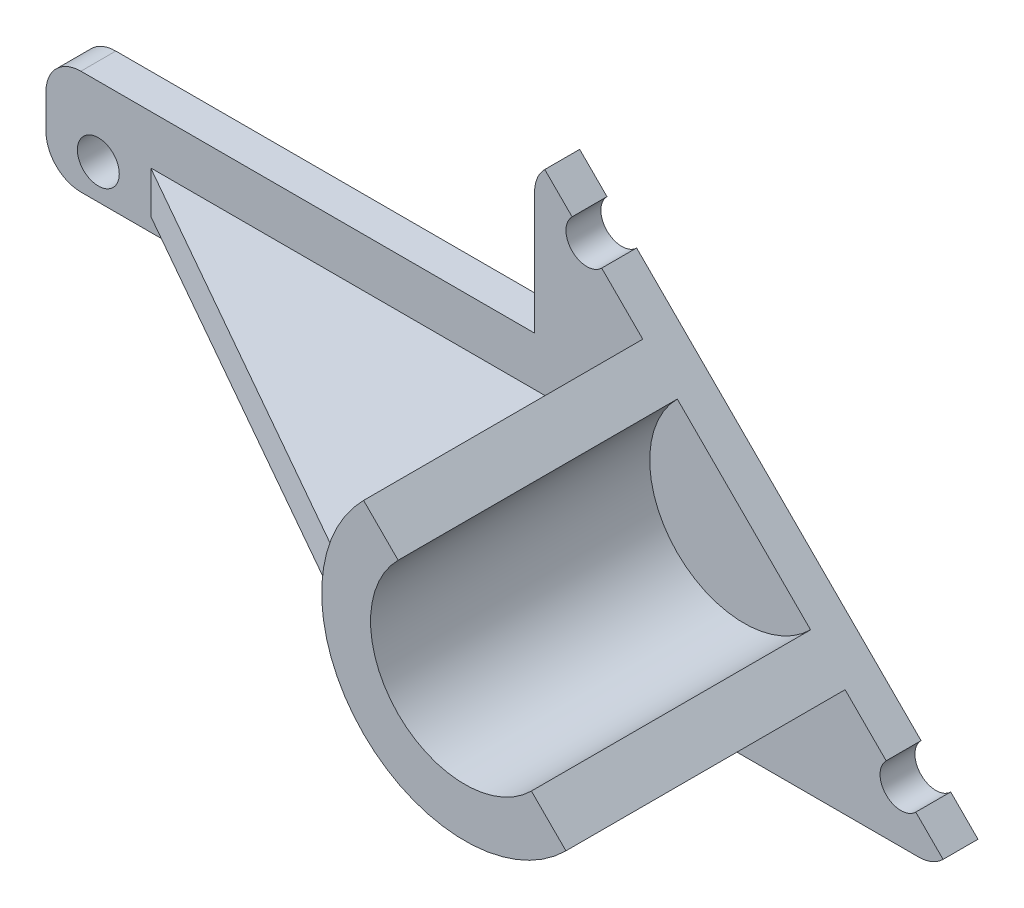
ISO-10303-21;
HEADER;
FILE_DESCRIPTION(('STEP AP214'),'2;1');
FILE_NAME('part.step','',(''),(''),'','','');
FILE_SCHEMA(('AUTOMOTIVE_DESIGN { 1 0 10303 214 1 1 1 1 }'));
ENDSEC;
DATA;
#1=APPLICATION_CONTEXT('core data for automotive mechanical design processes');
#2=APPLICATION_PROTOCOL_DEFINITION('international standard','automotive_design',2000,#1);
#3=PRODUCT_CONTEXT('',#1,'mechanical');
#4=PRODUCT('Part','Part','',(#3));
#5=PRODUCT_RELATED_PRODUCT_CATEGORY('part','',(#4));
#6=PRODUCT_DEFINITION_FORMATION('','',#4);
#7=PRODUCT_DEFINITION_CONTEXT('part definition',#1,'design');
#8=PRODUCT_DEFINITION('design','',#6,#7);
#9=PRODUCT_DEFINITION_SHAPE('','',#8);
#10=(LENGTH_UNIT() NAMED_UNIT(*) SI_UNIT(.MILLI.,.METRE.));
#11=(NAMED_UNIT(*) PLANE_ANGLE_UNIT() SI_UNIT($,.RADIAN.));
#12=(NAMED_UNIT(*) SI_UNIT($,.STERADIAN.) SOLID_ANGLE_UNIT());
#13=UNCERTAINTY_MEASURE_WITH_UNIT(LENGTH_MEASURE(1.E-05),#10,'distance_accuracy_value','');
#14=(GEOMETRIC_REPRESENTATION_CONTEXT(3) GLOBAL_UNCERTAINTY_ASSIGNED_CONTEXT((#13)) GLOBAL_UNIT_ASSIGNED_CONTEXT((#10,
#11,#12)) REPRESENTATION_CONTEXT('',''));
#15=CARTESIAN_POINT('',(0.,0.,0.));
#16=DIRECTION('',(0.,0.,1.));
#17=DIRECTION('',(1.,0.,0.));
#18=AXIS2_PLACEMENT_3D('',#15,#16,#17);
#19=CARTESIAN_POINT('',(-23.5355339059327,37.3526354515535,5.));
#20=DIRECTION('',(-0.707106781186548,-0.707106781186548,0.));
#21=DIRECTION('',(0.707106781186548,-0.707106781186548,0.));
#22=AXIS2_PLACEMENT_3D('',#19,#20,#21);
#23=PLANE('',#22);
#24=DIRECTION('',(-0.707106781186547,0.707106781186547,0.));
#25=VECTOR('',#24,1.);
#26=CARTESIAN_POINT('',(-23.5355339059327,37.3526354515535,0.));
#27=LINE('',#26,#25);
#28=CARTESIAN_POINT('',(33.5355339059327,-19.718432360312,0.));
#29=VERTEX_POINT('',#28);
#30=CARTESIAN_POINT('',(29.6213203435596,-15.8042187979389,0.));
#31=VERTEX_POINT('',#30);
#32=EDGE_CURVE('E369',#29,#31,#27,.T.);
#33=ORIENTED_EDGE('',*,*,#32,.T.);
#34=DIRECTION('',(0.,0.,1.));
#35=VECTOR('',#34,1.);
#36=CARTESIAN_POINT('',(29.6213203435596,-15.8042187979389,-35.));
#37=LINE('',#36,#35);
#38=CARTESIAN_POINT('',(29.6213203435596,-15.8042187979389,5.));
#39=VERTEX_POINT('',#38);
#40=EDGE_CURVE('E53',#31,#39,#37,.T.);
#41=ORIENTED_EDGE('',*,*,#40,.T.);
#42=DIRECTION('',(-0.707106781186547,0.707106781186547,0.));
#43=VECTOR('',#42,1.);
#44=CARTESIAN_POINT('',(-23.5355339059327,37.3526354515535,5.));
#45=LINE('',#44,#43);
#46=CARTESIAN_POINT('',(33.5355339059327,-19.718432360312,5.));
#47=VERTEX_POINT('',#46);
#48=EDGE_CURVE('E210',#47,#39,#45,.T.);
#49=ORIENTED_EDGE('',*,*,#48,.F.);
#50=DIRECTION('',(0.,0.,-1.));
#51=VECTOR('',#50,1.);
#52=CARTESIAN_POINT('',(33.5355339059327,-19.718432360312,5.));
#53=LINE('',#52,#51);
#54=EDGE_CURVE('E371',#47,#29,#53,.T.);
#55=ORIENTED_EDGE('',*,*,#54,.T.);
#56=EDGE_LOOP('',(#33,#41,#49,#55));
#57=FACE_BOUND('',#56,.T.);
#58=ADVANCED_FACE('F36',(#57),#23,.F.);
#59=CARTESIAN_POINT('',(25.3786796564403,-11.5615781108196,5.));
#60=VERTEX_POINT('',#59);
#61=CARTESIAN_POINT('',(19.4956890143242,-5.67858746870349,5.));
#62=VERTEX_POINT('',#61);
#63=EDGE_CURVE('E40',#60,#62,#45,.T.);
#64=ORIENTED_EDGE('',*,*,#63,.F.);
#65=DIRECTION('',(0.,0.,1.));
#66=VECTOR('',#65,1.);
#67=CARTESIAN_POINT('',(25.3786796564403,-11.5615781108196,-35.));
#68=LINE('',#67,#66);
#69=CARTESIAN_POINT('',(25.3786796564403,-11.5615781108196,0.));
#70=VERTEX_POINT('',#69);
#71=EDGE_CURVE('E197',#60,#70,#68,.F.);
#72=ORIENTED_EDGE('',*,*,#71,.T.);
#73=CARTESIAN_POINT('',(-15.3786796564404,29.1957812020611,0.));
#74=VERTEX_POINT('',#73);
#75=EDGE_CURVE('E60',#70,#74,#27,.T.);
#76=ORIENTED_EDGE('',*,*,#75,.T.);
#77=DIRECTION('',(0.,0.,1.));
#78=VECTOR('',#77,1.);
#79=CARTESIAN_POINT('',(-15.3786796564404,29.1957812020611,-35.));
#80=LINE('',#79,#78);
#81=CARTESIAN_POINT('',(-15.3786796564404,29.1957812020611,5.));
#82=VERTEX_POINT('',#81);
#83=EDGE_CURVE('E358',#74,#82,#80,.T.);
#84=ORIENTED_EDGE('',*,*,#83,.T.);
#85=CARTESIAN_POINT('',(-9.49568901432423,23.312790559945,5.));
#86=VERTEX_POINT('',#85);
#87=EDGE_CURVE('E220',#86,#82,#45,.T.);
#88=ORIENTED_EDGE('',*,*,#87,.F.);
#89=DIRECTION('',(0.,0.,-1.));
#90=VECTOR('',#89,1.);
#91=CARTESIAN_POINT('',(-9.49568901432423,23.312790559945,45.));
#92=LINE('',#91,#90);
#93=CARTESIAN_POINT('',(-9.49568901432423,23.312790559945,45.));
#94=VERTEX_POINT('',#93);
#95=EDGE_CURVE('E299',#94,#86,#92,.T.);
#96=ORIENTED_EDGE('',*,*,#95,.F.);
#97=DIRECTION('',(-0.707106781186548,0.707106781186548,0.));
#98=VECTOR('',#97,1.);
#99=CARTESIAN_POINT('',(6.90855077281037,6.90855077281037,45.));
#100=LINE('',#99,#98);
#101=CARTESIAN_POINT('',(-4.5459415460184,18.3630430916391,45.));
#102=VERTEX_POINT('',#101);
#103=EDGE_CURVE('E321',#102,#94,#100,.T.);
#104=ORIENTED_EDGE('',*,*,#103,.F.);
#105=DIRECTION('',(0.,0.,-1.));
#106=VECTOR('',#105,1.);
#107=CARTESIAN_POINT('',(-4.5459415460184,18.3630430916391,45.));
#108=LINE('',#107,#106);
#109=CARTESIAN_POINT('',(-4.54594154601841,18.3630430916391,5.));
#110=VERTEX_POINT('',#109);
#111=EDGE_CURVE('E305',#102,#110,#108,.T.);
#112=ORIENTED_EDGE('',*,*,#111,.T.);
#113=CARTESIAN_POINT('',(14.5459415460184,-0.728840000397642,5.));
#114=VERTEX_POINT('',#113);
#115=EDGE_CURVE('E217',#114,#110,#45,.T.);
#116=ORIENTED_EDGE('',*,*,#115,.F.);
#117=DIRECTION('',(0.,0.,-1.));
#118=VECTOR('',#117,1.);
#119=CARTESIAN_POINT('',(14.5459415460184,-0.728840000397655,45.));
#120=LINE('',#119,#118);
#121=CARTESIAN_POINT('',(14.5459415460184,-0.728840000397655,45.));
#122=VERTEX_POINT('',#121);
#123=EDGE_CURVE('E300',#122,#114,#120,.T.);
#124=ORIENTED_EDGE('',*,*,#123,.F.);
#125=CARTESIAN_POINT('',(19.4956890143242,-5.67858746870349,45.));
#126=VERTEX_POINT('',#125);
#127=EDGE_CURVE('E314',#126,#122,#100,.T.);
#128=ORIENTED_EDGE('',*,*,#127,.F.);
#129=DIRECTION('',(0.,0.,-1.));
#130=VECTOR('',#129,1.);
#131=CARTESIAN_POINT('',(19.4956890143242,-5.67858746870349,45.));
#132=LINE('',#131,#130);
#133=EDGE_CURVE('E216',#126,#62,#132,.T.);
#134=ORIENTED_EDGE('',*,*,#133,.T.);
#135=EDGE_LOOP('',(#64,#72,#76,#84,#88,#96,#104,#112,#116,#124,#128,#134));
#136=FACE_BOUND('',#135,.T.);
#137=ADVANCED_FACE('F213',(#136),#23,.F.);
#138=CARTESIAN_POINT('',(-20.,33.8171015456207,5.));
#139=DIRECTION('',(0.,0.,1.));
#140=DIRECTION('',(1.,0.,0.));
#141=AXIS2_PLACEMENT_3D('',#138,#139,#140);
#142=PLANE('',#141);
#143=ORIENTED_EDGE('',*,*,#115,.T.);
#144=CARTESIAN_POINT('',(4.99999999999999,8.81710154562074,5.));
#145=DIRECTION('',(0.,0.,1.));
#146=DIRECTION('',(1.,0.,0.));
#147=AXIS2_PLACEMENT_3D('',#144,#145,#146);
#148=CIRCLE('',#147,13.5);
#149=EDGE_CURVE('E285',#110,#114,#148,.T.);
#150=ORIENTED_EDGE('',*,*,#149,.T.);
#151=EDGE_LOOP('',(#143,#150));
#152=FACE_BOUND('',#151,.T.);
#153=ADVANCED_FACE('F489',(#152),#142,.T.);
#154=CARTESIAN_POINT('',(-25.,-21.1828984543793,5.));
#155=DIRECTION('',(1.,0.,0.));
#156=DIRECTION('',(0.,1.,0.));
#157=AXIS2_PLACEMENT_3D('',#154,#155,#156);
#158=PLANE('',#157);
#159=DIRECTION('',(0.,-1.,0.));
#160=VECTOR('',#159,1.);
#161=CARTESIAN_POINT('',(-25.,-21.1828984543793,0.));
#162=LINE('',#161,#160);
#163=CARTESIAN_POINT('',(-25.,1.31710154562074,0.));
#164=VERTEX_POINT('',#163);
#165=CARTESIAN_POINT('',(-25.,-16.1828984543793,0.));
#166=VERTEX_POINT('',#165);
#167=EDGE_CURVE('E309',#164,#166,#162,.T.);
#168=ORIENTED_EDGE('',*,*,#167,.T.);
#169=DIRECTION('',(0.,0.,-1.));
#170=VECTOR('',#169,1.);
#171=CARTESIAN_POINT('',(-25.,-16.1828984543793,5.));
#172=LINE('',#171,#170);
#173=CARTESIAN_POINT('',(-25.,-16.1828984543793,5.));
#174=VERTEX_POINT('',#173);
#175=EDGE_CURVE('E269',#166,#174,#172,.F.);
#176=ORIENTED_EDGE('',*,*,#175,.T.);
#177=DIRECTION('',(0.,-1.,0.));
#178=VECTOR('',#177,1.);
#179=CARTESIAN_POINT('',(-25.,-21.1828984543793,5.));
#180=LINE('',#179,#178);
#181=CARTESIAN_POINT('',(-25.,1.31710154562074,5.));
#182=VERTEX_POINT('',#181);
#183=EDGE_CURVE('E293',#182,#174,#180,.T.);
#184=ORIENTED_EDGE('',*,*,#183,.F.);
#185=DIRECTION('',(0.,0.,-1.));
#186=VECTOR('',#185,1.);
#187=CARTESIAN_POINT('',(-25.,1.31710154562074,5.));
#188=LINE('',#187,#186);
#189=EDGE_CURVE('E394',#182,#164,#188,.T.);
#190=ORIENTED_EDGE('',*,*,#189,.T.);
#191=EDGE_LOOP('',(#168,#176,#184,#190));
#192=FACE_BOUND('',#191,.T.);
#193=ADVANCED_FACE('F466',(#192),#158,.F.);
#194=CARTESIAN_POINT('',(-25.,-21.1828984543793,5.));
#195=DIRECTION('',(0.,1.,0.));
#196=DIRECTION('',(-1.,0.,0.));
#197=AXIS2_PLACEMENT_3D('',#194,#195,#196);
#198=PLANE('',#197);
#199=DIRECTION('',(1.,0.,0.));
#200=VECTOR('',#199,1.);
#201=CARTESIAN_POINT('',(-25.,-21.1828984543793,5.));
#202=LINE('',#201,#200);
#203=CARTESIAN_POINT('',(-20.,-21.1828984543793,5.));
#204=VERTEX_POINT('',#203);
#205=CARTESIAN_POINT('',(30.,-21.1828984543793,5.));
#206=VERTEX_POINT('',#205);
#207=EDGE_CURVE('E458',#204,#206,#202,.T.);
#208=ORIENTED_EDGE('',*,*,#207,.F.);
#209=DIRECTION('',(0.,0.,-1.));
#210=VECTOR('',#209,1.);
#211=CARTESIAN_POINT('',(-20.,-21.1828984543793,5.));
#212=LINE('',#211,#210);
#213=CARTESIAN_POINT('',(-20.,-21.1828984543793,0.));
#214=VERTEX_POINT('',#213);
#215=EDGE_CURVE('E277',#204,#214,#212,.T.);
#216=ORIENTED_EDGE('',*,*,#215,.T.);
#217=DIRECTION('',(1.,0.,0.));
#218=VECTOR('',#217,1.);
#219=CARTESIAN_POINT('',(-25.,-21.1828984543793,0.));
#220=LINE('',#219,#218);
#221=CARTESIAN_POINT('',(30.,-21.1828984543793,0.));
#222=VERTEX_POINT('',#221);
#223=EDGE_CURVE('E385',#214,#222,#220,.T.);
#224=ORIENTED_EDGE('',*,*,#223,.T.);
#225=DIRECTION('',(0.,0.,-1.));
#226=VECTOR('',#225,1.);
#227=CARTESIAN_POINT('',(30.,-21.1828984543793,5.));
#228=LINE('',#227,#226);
#229=EDGE_CURVE('E280',#206,#222,#228,.T.);
#230=ORIENTED_EDGE('',*,*,#229,.F.);
#231=EDGE_LOOP('',(#208,#216,#224,#230));
#232=FACE_BOUND('',#231,.T.);
#233=ADVANCED_FACE('F456',(#232),#198,.F.);
#234=CARTESIAN_POINT('',(30.,-16.1828984543793,5.));
#235=DIRECTION('',(0.,0.,-1.));
#236=DIRECTION('',(-1.,0.,0.));
#237=AXIS2_PLACEMENT_3D('',#234,#235,#236);
#238=CYLINDRICAL_SURFACE('',#237,5.);
#239=CARTESIAN_POINT('',(30.,-16.1828984543793,0.));
#240=DIRECTION('',(0.,0.,1.));
#241=DIRECTION('',(1.,0.,0.));
#242=AXIS2_PLACEMENT_3D('',#239,#240,#241);
#243=CIRCLE('',#242,5.);
#244=EDGE_CURVE('E380',#222,#29,#243,.T.);
#245=ORIENTED_EDGE('',*,*,#244,.T.);
#246=ORIENTED_EDGE('',*,*,#54,.F.);
#247=CARTESIAN_POINT('',(30.,-16.1828984543793,5.));
#248=DIRECTION('',(0.,0.,1.));
#249=DIRECTION('',(1.,0.,0.));
#250=AXIS2_PLACEMENT_3D('',#247,#248,#249);
#251=CIRCLE('',#250,5.);
#252=EDGE_CURVE('E233',#206,#47,#251,.T.);
#253=ORIENTED_EDGE('',*,*,#252,.F.);
#254=ORIENTED_EDGE('',*,*,#229,.T.);
#255=EDGE_LOOP('',(#245,#246,#253,#254));
#256=FACE_BOUND('',#255,.T.);
#257=ADVANCED_FACE('F451',(#256),#238,.T.);
#258=CARTESIAN_POINT('',(-19.6213203435596,33.4384218891804,5.));
#259=VERTEX_POINT('',#258);
#260=CARTESIAN_POINT('',(-23.5355339059327,37.3526354515535,5.));
#261=VERTEX_POINT('',#260);
#262=EDGE_CURVE('E226',#259,#261,#45,.T.);
#263=ORIENTED_EDGE('',*,*,#262,.F.);
#264=DIRECTION('',(0.,0.,1.));
#265=VECTOR('',#264,1.);
#266=CARTESIAN_POINT('',(-19.6213203435596,33.4384218891804,-35.));
#267=LINE('',#266,#265);
#268=CARTESIAN_POINT('',(-19.6213203435596,33.4384218891804,0.));
#269=VERTEX_POINT('',#268);
#270=EDGE_CURVE('E360',#259,#269,#267,.F.);
#271=ORIENTED_EDGE('',*,*,#270,.T.);
#272=CARTESIAN_POINT('',(-23.5355339059327,37.3526354515535,0.));
#273=VERTEX_POINT('',#272);
#274=EDGE_CURVE('E376',#269,#273,#27,.T.);
#275=ORIENTED_EDGE('',*,*,#274,.T.);
#276=DIRECTION('',(0.,0.,-1.));
#277=VECTOR('',#276,1.);
#278=CARTESIAN_POINT('',(-23.5355339059327,37.3526354515535,5.));
#279=LINE('',#278,#277);
#280=EDGE_CURVE('E414',#261,#273,#279,.T.);
#281=ORIENTED_EDGE('',*,*,#280,.F.);
#282=EDGE_LOOP('',(#263,#271,#275,#281));
#283=FACE_BOUND('',#282,.T.);
#284=ADVANCED_FACE('F485',(#283),#23,.F.);
#285=CARTESIAN_POINT('',(-20.,33.8171015456207,5.));
#286=DIRECTION('',(0.,0.,-1.));
#287=DIRECTION('',(-1.,0.,0.));
#288=AXIS2_PLACEMENT_3D('',#285,#286,#287);
#289=CYLINDRICAL_SURFACE('',#288,5.);
#290=CARTESIAN_POINT('',(-20.,33.8171015456207,0.));
#291=DIRECTION('',(0.,0.,1.));
#292=DIRECTION('',(1.,0.,0.));
#293=AXIS2_PLACEMENT_3D('',#290,#291,#292);
#294=CIRCLE('',#293,5.);
#295=CARTESIAN_POINT('',(-25.,33.8171015456207,0.));
#296=VERTEX_POINT('',#295);
#297=EDGE_CURVE('E374',#273,#296,#294,.T.);
#298=ORIENTED_EDGE('',*,*,#297,.T.);
#299=DIRECTION('',(0.,0.,-1.));
#300=VECTOR('',#299,1.);
#301=CARTESIAN_POINT('',(-25.,33.8171015456207,5.));
#302=LINE('',#301,#300);
#303=CARTESIAN_POINT('',(-25.,33.8171015456207,5.));
#304=VERTEX_POINT('',#303);
#305=EDGE_CURVE('E409',#304,#296,#302,.T.);
#306=ORIENTED_EDGE('',*,*,#305,.F.);
#307=CARTESIAN_POINT('',(-20.,33.8171015456207,5.));
#308=DIRECTION('',(0.,0.,1.));
#309=DIRECTION('',(1.,0.,0.));
#310=AXIS2_PLACEMENT_3D('',#307,#308,#309);
#311=CIRCLE('',#310,5.);
#312=EDGE_CURVE('E218',#261,#304,#311,.T.);
#313=ORIENTED_EDGE('',*,*,#312,.F.);
#314=ORIENTED_EDGE('',*,*,#280,.T.);
#315=EDGE_LOOP('',(#298,#306,#313,#314));
#316=FACE_BOUND('',#315,.T.);
#317=ADVANCED_FACE('F410',(#316),#289,.T.);
#318=CARTESIAN_POINT('',(-25.,16.3171015456207,5.));
#319=DIRECTION('',(1.,0.,0.));
#320=DIRECTION('',(0.,0.,-1.));
#321=AXIS2_PLACEMENT_3D('',#318,#319,#320);
#322=PLANE('',#321);
#323=DIRECTION('',(0.,-1.,0.));
#324=VECTOR('',#323,1.);
#325=CARTESIAN_POINT('',(-25.,16.3171015456207,0.));
#326=LINE('',#325,#324);
#327=CARTESIAN_POINT('',(-25.,16.3171015456207,0.));
#328=VERTEX_POINT('',#327);
#329=EDGE_CURVE('E377',#296,#328,#326,.T.);
#330=ORIENTED_EDGE('',*,*,#329,.T.);
#331=DIRECTION('',(0.,0.,-1.));
#332=VECTOR('',#331,1.);
#333=CARTESIAN_POINT('',(-25.,16.3171015456207,5.));
#334=LINE('',#333,#332);
#335=CARTESIAN_POINT('',(-25.,16.3171015456207,5.));
#336=VERTEX_POINT('',#335);
#337=EDGE_CURVE('E415',#336,#328,#334,.T.);
#338=ORIENTED_EDGE('',*,*,#337,.F.);
#339=DIRECTION('',(0.,-1.,0.));
#340=VECTOR('',#339,1.);
#341=CARTESIAN_POINT('',(-25.,16.3171015456207,5.));
#342=LINE('',#341,#340);
#343=EDGE_CURVE('E400',#304,#336,#342,.T.);
#344=ORIENTED_EDGE('',*,*,#343,.F.);
#345=ORIENTED_EDGE('',*,*,#305,.T.);
#346=EDGE_LOOP('',(#330,#338,#344,#345));
#347=FACE_BOUND('',#346,.T.);
#348=ADVANCED_FACE('F417',(#347),#322,.F.);
#349=CARTESIAN_POINT('',(-25.,16.3171015456207,5.));
#350=DIRECTION('',(0.,-1.,0.));
#351=DIRECTION('',(1.,0.,0.));
#352=AXIS2_PLACEMENT_3D('',#349,#350,#351);
#353=PLANE('',#352);
#354=DIRECTION('',(-1.,0.,0.));
#355=VECTOR('',#354,1.);
#356=CARTESIAN_POINT('',(-25.,16.3171015456207,0.));
#357=LINE('',#356,#355);
#358=CARTESIAN_POINT('',(-90.,16.3171015456207,0.));
#359=VERTEX_POINT('',#358);
#360=EDGE_CURVE('E440',#328,#359,#357,.T.);
#361=ORIENTED_EDGE('',*,*,#360,.T.);
#362=DIRECTION('',(0.,0.,-1.));
#363=VECTOR('',#362,1.);
#364=CARTESIAN_POINT('',(-90.,16.3171015456207,5.));
#365=LINE('',#364,#363);
#366=CARTESIAN_POINT('',(-90.,16.3171015456207,5.));
#367=VERTEX_POINT('',#366);
#368=EDGE_CURVE('E256',#359,#367,#365,.F.);
#369=ORIENTED_EDGE('',*,*,#368,.T.);
#370=DIRECTION('',(-1.,0.,0.));
#371=VECTOR('',#370,1.);
#372=CARTESIAN_POINT('',(-25.,16.3171015456207,5.));
#373=LINE('',#372,#371);
#374=EDGE_CURVE('E398',#336,#367,#373,.T.);
#375=ORIENTED_EDGE('',*,*,#374,.F.);
#376=ORIENTED_EDGE('',*,*,#337,.T.);
#377=EDGE_LOOP('',(#361,#369,#375,#376));
#378=FACE_BOUND('',#377,.T.);
#379=ADVANCED_FACE('F424',(#378),#353,.F.);
#380=CARTESIAN_POINT('',(-95.,16.3171015456207,5.));
#381=DIRECTION('',(1.,0.,0.));
#382=DIRECTION('',(0.,0.,-1.));
#383=AXIS2_PLACEMENT_3D('',#380,#381,#382);
#384=PLANE('',#383);
#385=DIRECTION('',(0.,-1.,0.));
#386=VECTOR('',#385,1.);
#387=CARTESIAN_POINT('',(-95.,16.3171015456207,5.));
#388=LINE('',#387,#386);
#389=CARTESIAN_POINT('',(-95.,11.3171015456207,5.));
#390=VERTEX_POINT('',#389);
#391=CARTESIAN_POINT('',(-95.,6.31710154562074,5.));
#392=VERTEX_POINT('',#391);
#393=EDGE_CURVE('E395',#390,#392,#388,.T.);
#394=ORIENTED_EDGE('',*,*,#393,.F.);
#395=DIRECTION('',(0.,0.,-1.));
#396=VECTOR('',#395,1.);
#397=CARTESIAN_POINT('',(-95.,11.3171015456207,5.));
#398=LINE('',#397,#396);
#399=CARTESIAN_POINT('',(-95.,11.3171015456207,0.));
#400=VERTEX_POINT('',#399);
#401=EDGE_CURVE('E258',#390,#400,#398,.T.);
#402=ORIENTED_EDGE('',*,*,#401,.T.);
#403=DIRECTION('',(0.,-1.,0.));
#404=VECTOR('',#403,1.);
#405=CARTESIAN_POINT('',(-95.,16.3171015456207,0.));
#406=LINE('',#405,#404);
#407=CARTESIAN_POINT('',(-95.,6.31710154562074,0.));
#408=VERTEX_POINT('',#407);
#409=EDGE_CURVE('E435',#400,#408,#406,.T.);
#410=ORIENTED_EDGE('',*,*,#409,.T.);
#411=DIRECTION('',(0.,0.,-1.));
#412=VECTOR('',#411,1.);
#413=CARTESIAN_POINT('',(-95.,6.31710154562074,5.));
#414=LINE('',#413,#412);
#415=EDGE_CURVE('E261',#408,#392,#414,.F.);
#416=ORIENTED_EDGE('',*,*,#415,.T.);
#417=EDGE_LOOP('',(#394,#402,#410,#416));
#418=FACE_BOUND('',#417,.T.);
#419=ADVANCED_FACE('F434',(#418),#384,.F.);
#420=CARTESIAN_POINT('',(-95.,1.31710154562074,5.));
#421=DIRECTION('',(0.,1.,0.));
#422=DIRECTION('',(0.,0.,1.));
#423=AXIS2_PLACEMENT_3D('',#420,#421,#422);
#424=PLANE('',#423);
#425=DIRECTION('',(1.,0.,0.));
#426=VECTOR('',#425,1.);
#427=CARTESIAN_POINT('',(-95.,1.31710154562074,5.));
#428=LINE('',#427,#426);
#429=CARTESIAN_POINT('',(-90.,1.31710154562074,5.));
#430=VERTEX_POINT('',#429);
#431=EDGE_CURVE('E392',#430,#182,#428,.T.);
#432=ORIENTED_EDGE('',*,*,#431,.F.);
#433=DIRECTION('',(0.,0.,-1.));
#434=VECTOR('',#433,1.);
#435=CARTESIAN_POINT('',(-90.,1.31710154562074,5.));
#436=LINE('',#435,#434);
#437=CARTESIAN_POINT('',(-90.,1.31710154562074,0.));
#438=VERTEX_POINT('',#437);
#439=EDGE_CURVE('E244',#430,#438,#436,.T.);
#440=ORIENTED_EDGE('',*,*,#439,.T.);
#441=DIRECTION('',(1.,0.,0.));
#442=VECTOR('',#441,1.);
#443=CARTESIAN_POINT('',(-95.,1.31710154562074,0.));
#444=LINE('',#443,#442);
#445=EDGE_CURVE('E439',#438,#164,#444,.T.);
#446=ORIENTED_EDGE('',*,*,#445,.T.);
#447=ORIENTED_EDGE('',*,*,#189,.F.);
#448=EDGE_LOOP('',(#432,#440,#446,#447));
#449=FACE_BOUND('',#448,.T.);
#450=ADVANCED_FACE('F472',(#449),#424,.F.);
#451=CARTESIAN_POINT('',(27.5,-13.6828984543793,5.));
#452=DIRECTION('',(0.,0.,1.));
#453=DIRECTION('',(1.,0.,0.));
#454=AXIS2_PLACEMENT_3D('',#451,#452,#453);
#455=CIRCLE('',#454,2.99999999999999);
#456=EDGE_CURVE('E200',#60,#39,#455,.T.);
#457=ORIENTED_EDGE('',*,*,#456,.F.);
#458=ORIENTED_EDGE('',*,*,#63,.T.);
#459=CARTESIAN_POINT('',(4.99999999999999,8.81710154562074,5.));
#460=DIRECTION('',(0.,0.,1.));
#461=DIRECTION('',(1.,0.,0.));
#462=AXIS2_PLACEMENT_3D('',#459,#460,#461);
#463=CIRCLE('',#462,20.5);
#464=CARTESIAN_POINT('',(-14.7484176581315,3.31710154562079,5.));
#465=VERTEX_POINT('',#464);
#466=EDGE_CURVE('E281',#465,#62,#463,.T.);
#467=ORIENTED_EDGE('',*,*,#466,.F.);
#468=DIRECTION('',(-1.,0.,0.));
#469=VECTOR('',#468,1.);
#470=CARTESIAN_POINT('',(283614.719359013,3.31710154562057,4.99999999999545));
#471=LINE('',#470,#469);
#472=CARTESIAN_POINT('',(-79.8319729157984,3.31710154562083,5.));
#473=VERTEX_POINT('',#472);
#474=EDGE_CURVE('E331',#465,#473,#471,.T.);
#475=ORIENTED_EDGE('',*,*,#474,.T.);
#476=DIRECTION('',(0.,-1.,0.));
#477=VECTOR('',#476,1.);
#478=CARTESIAN_POINT('',(-79.8319729158266,3.31710154631254,5.0000000000523));
#479=LINE('',#478,#477);
#480=CARTESIAN_POINT('',(-79.8319729158834,9.31710154562082,5.));
#481=VERTEX_POINT('',#480);
#482=EDGE_CURVE('E339',#481,#473,#479,.T.);
#483=ORIENTED_EDGE('',*,*,#482,.F.);
#484=DIRECTION('',(-1.,0.,0.));
#485=VECTOR('',#484,1.);
#486=CARTESIAN_POINT('',(283614.719359013,9.31710154562056,4.99999999999545));
#487=LINE('',#486,#485);
#488=CARTESIAN_POINT('',(-15.4939015319192,9.31710154562078,5.));
#489=VERTEX_POINT('',#488);
#490=EDGE_CURVE('E349',#489,#481,#487,.T.);
#491=ORIENTED_EDGE('',*,*,#490,.F.);
#492=EDGE_CURVE('E284',#86,#489,#463,.T.);
#493=ORIENTED_EDGE('',*,*,#492,.F.);
#494=ORIENTED_EDGE('',*,*,#87,.T.);
#495=CARTESIAN_POINT('',(-17.5,31.3171015456207,5.));
#496=DIRECTION('',(0.,0.,1.));
#497=DIRECTION('',(1.,0.,0.));
#498=AXIS2_PLACEMENT_3D('',#495,#496,#497);
#499=CIRCLE('',#498,3.);
#500=EDGE_CURVE('E363',#259,#82,#499,.T.);
#501=ORIENTED_EDGE('',*,*,#500,.F.);
#502=ORIENTED_EDGE('',*,*,#262,.T.);
#503=ORIENTED_EDGE('',*,*,#312,.T.);
#504=ORIENTED_EDGE('',*,*,#343,.T.);
#505=ORIENTED_EDGE('',*,*,#374,.T.);
#506=CARTESIAN_POINT('',(-90.,11.3171015456207,5.));
#507=DIRECTION('',(0.,0.,1.));
#508=DIRECTION('',(1.,0.,0.));
#509=AXIS2_PLACEMENT_3D('',#506,#507,#508);
#510=CIRCLE('',#509,5.);
#511=EDGE_CURVE('E265',#367,#390,#510,.T.);
#512=ORIENTED_EDGE('',*,*,#511,.T.);
#513=ORIENTED_EDGE('',*,*,#393,.T.);
#514=CARTESIAN_POINT('',(-90.,6.31710154562074,5.));
#515=DIRECTION('',(0.,0.,1.));
#516=DIRECTION('',(1.,0.,0.));
#517=AXIS2_PLACEMENT_3D('',#514,#515,#516);
#518=CIRCLE('',#517,5.);
#519=EDGE_CURVE('E267',#392,#430,#518,.T.);
#520=ORIENTED_EDGE('',*,*,#519,.T.);
#521=ORIENTED_EDGE('',*,*,#431,.T.);
#522=ORIENTED_EDGE('',*,*,#183,.T.);
#523=CARTESIAN_POINT('',(-20.,-16.1828984543793,5.));
#524=DIRECTION('',(0.,0.,1.));
#525=DIRECTION('',(1.,0.,0.));
#526=AXIS2_PLACEMENT_3D('',#523,#524,#525);
#527=CIRCLE('',#526,5.);
#528=EDGE_CURVE('E263',#174,#204,#527,.T.);
#529=ORIENTED_EDGE('',*,*,#528,.T.);
#530=ORIENTED_EDGE('',*,*,#207,.T.);
#531=ORIENTED_EDGE('',*,*,#252,.T.);
#532=ORIENTED_EDGE('',*,*,#48,.T.);
#533=EDGE_LOOP('',(#457,#458,#467,#475,#483,#491,#493,#494,#501,#502,#503,#504,#505,#512,#513,
#520,#521,#522,#529,#530,#531,#532));
#534=FACE_BOUND('',#533,.T.);
#535=CARTESIAN_POINT('',(-17.5,-13.6828984543793,5.));
#536=DIRECTION('',(0.,0.,1.));
#537=DIRECTION('',(1.,0.,0.));
#538=AXIS2_PLACEMENT_3D('',#535,#536,#537);
#539=CIRCLE('',#538,3.);
#540=CARTESIAN_POINT('',(-14.5,-13.6828984543793,5.));
#541=VERTEX_POINT('',#540);
#542=EDGE_CURVE('E249',#541,#541,#539,.T.);
#543=ORIENTED_EDGE('',*,*,#542,.F.);
#544=EDGE_LOOP('',(#543));
#545=FACE_BOUND('',#544,.T.);
#546=CARTESIAN_POINT('',(-87.5,6.31710154562073,5.));
#547=DIRECTION('',(0.,0.,1.));
#548=DIRECTION('',(1.,0.,0.));
#549=AXIS2_PLACEMENT_3D('',#546,#547,#548);
#550=CIRCLE('',#549,3.00000000000001);
#551=CARTESIAN_POINT('',(-84.5,6.31710154562073,5.));
#552=VERTEX_POINT('',#551);
#553=EDGE_CURVE('E248',#552,#552,#550,.T.);
#554=ORIENTED_EDGE('',*,*,#553,.F.);
#555=EDGE_LOOP('',(#554));
#556=FACE_BOUND('',#555,.T.);
#557=ADVANCED_FACE('F205',(#534,#545,#556),#142,.T.);
#558=CARTESIAN_POINT('',(-20.,33.8171015456207,0.));
#559=DIRECTION('',(0.,0.,1.));
#560=DIRECTION('',(1.,0.,0.));
#561=AXIS2_PLACEMENT_3D('',#558,#559,#560);
#562=PLANE('',#561);
#563=CARTESIAN_POINT('',(-17.5,-13.6828984543793,0.));
#564=DIRECTION('',(0.,0.,1.));
#565=DIRECTION('',(1.,0.,0.));
#566=AXIS2_PLACEMENT_3D('',#563,#564,#565);
#567=CIRCLE('',#566,3.);
#568=CARTESIAN_POINT('',(-14.5,-13.6828984543793,0.));
#569=VERTEX_POINT('',#568);
#570=EDGE_CURVE('E245',#569,#569,#567,.T.);
#571=ORIENTED_EDGE('',*,*,#570,.T.);
#572=EDGE_LOOP('',(#571));
#573=FACE_BOUND('',#572,.T.);
#574=CARTESIAN_POINT('',(-87.5,6.31710154562073,0.));
#575=DIRECTION('',(0.,0.,1.));
#576=DIRECTION('',(1.,0.,0.));
#577=AXIS2_PLACEMENT_3D('',#574,#575,#576);
#578=CIRCLE('',#577,3.00000000000001);
#579=CARTESIAN_POINT('',(-84.5,6.31710154562073,0.));
#580=VERTEX_POINT('',#579);
#581=EDGE_CURVE('E250',#580,#580,#578,.T.);
#582=ORIENTED_EDGE('',*,*,#581,.T.);
#583=EDGE_LOOP('',(#582));
#584=FACE_BOUND('',#583,.T.);
#585=ORIENTED_EDGE('',*,*,#75,.F.);
#586=CARTESIAN_POINT('',(27.5,-13.6828984543793,0.));
#587=DIRECTION('',(0.,0.,1.));
#588=DIRECTION('',(1.,0.,0.));
#589=AXIS2_PLACEMENT_3D('',#586,#587,#588);
#590=CIRCLE('',#589,2.99999999999999);
#591=EDGE_CURVE('E12',#70,#31,#590,.T.);
#592=ORIENTED_EDGE('',*,*,#591,.T.);
#593=ORIENTED_EDGE('',*,*,#32,.F.);
#594=ORIENTED_EDGE('',*,*,#244,.F.);
#595=ORIENTED_EDGE('',*,*,#223,.F.);
#596=CARTESIAN_POINT('',(-20.,-16.1828984543793,0.));
#597=DIRECTION('',(0.,0.,1.));
#598=DIRECTION('',(1.,0.,0.));
#599=AXIS2_PLACEMENT_3D('',#596,#597,#598);
#600=CIRCLE('',#599,5.);
#601=EDGE_CURVE('E271',#214,#166,#600,.F.);
#602=ORIENTED_EDGE('',*,*,#601,.T.);
#603=ORIENTED_EDGE('',*,*,#167,.F.);
#604=ORIENTED_EDGE('',*,*,#445,.F.);
#605=CARTESIAN_POINT('',(-90.,6.31710154562074,0.));
#606=DIRECTION('',(0.,0.,1.));
#607=DIRECTION('',(1.,0.,0.));
#608=AXIS2_PLACEMENT_3D('',#605,#606,#607);
#609=CIRCLE('',#608,5.);
#610=EDGE_CURVE('E275',#438,#408,#609,.F.);
#611=ORIENTED_EDGE('',*,*,#610,.T.);
#612=ORIENTED_EDGE('',*,*,#409,.F.);
#613=CARTESIAN_POINT('',(-90.,11.3171015456207,0.));
#614=DIRECTION('',(0.,0.,1.));
#615=DIRECTION('',(1.,0.,0.));
#616=AXIS2_PLACEMENT_3D('',#613,#614,#615);
#617=CIRCLE('',#616,5.);
#618=EDGE_CURVE('E273',#400,#359,#617,.F.);
#619=ORIENTED_EDGE('',*,*,#618,.T.);
#620=ORIENTED_EDGE('',*,*,#360,.F.);
#621=ORIENTED_EDGE('',*,*,#329,.F.);
#622=ORIENTED_EDGE('',*,*,#297,.F.);
#623=ORIENTED_EDGE('',*,*,#274,.F.);
#624=CARTESIAN_POINT('',(-17.5,31.3171015456207,0.));
#625=DIRECTION('',(0.,0.,1.));
#626=DIRECTION('',(1.,0.,0.));
#627=AXIS2_PLACEMENT_3D('',#624,#625,#626);
#628=CIRCLE('',#627,3.);
#629=EDGE_CURVE('E46',#269,#74,#628,.T.);
#630=ORIENTED_EDGE('',*,*,#629,.T.);
#631=EDGE_LOOP('',(#585,#592,#593,#594,#595,#602,#603,#604,#611,#612,#619,#620,#621,#622,#623,#630));
#632=FACE_BOUND('',#631,.T.);
#633=ADVANCED_FACE('F437',(#573,#584,#632),#562,.F.);
#634=CARTESIAN_POINT('',(4.99999999999999,8.81710154562074,45.));
#635=DIRECTION('',(0.,0.,-1.));
#636=DIRECTION('',(-1.,0.,0.));
#637=AXIS2_PLACEMENT_3D('',#634,#635,#636);
#638=CYLINDRICAL_SURFACE('',#637,13.5);
#639=ORIENTED_EDGE('',*,*,#149,.F.);
#640=ORIENTED_EDGE('',*,*,#111,.F.);
#641=CARTESIAN_POINT('',(4.99999999999999,8.81710154562074,45.));
#642=DIRECTION('',(0.,0.,1.));
#643=DIRECTION('',(1.,0.,0.));
#644=AXIS2_PLACEMENT_3D('',#641,#642,#643);
#645=CIRCLE('',#644,13.5);
#646=EDGE_CURVE('E297',#102,#122,#645,.T.);
#647=ORIENTED_EDGE('',*,*,#646,.T.);
#648=ORIENTED_EDGE('',*,*,#123,.T.);
#649=EDGE_LOOP('',(#639,#640,#647,#648));
#650=FACE_BOUND('',#649,.T.);
#651=ADVANCED_FACE('F535',(#650),#638,.F.);
#652=CARTESIAN_POINT('',(4.99999999999999,8.81710154562074,45.));
#653=DIRECTION('',(0.,0.,-1.));
#654=DIRECTION('',(-1.,0.,0.));
#655=AXIS2_PLACEMENT_3D('',#652,#653,#654);
#656=CYLINDRICAL_SURFACE('',#655,20.5);
#657=CARTESIAN_POINT('',(4.99999999999999,8.81710154562074,53.2240015180174));
#658=DIRECTION('',(0.493456591685239,0.,-0.869770424952693));
#659=DIRECTION('',(-0.869770424952693,0.,-0.493456591685239));
#660=AXIS2_PLACEMENT_3D('',#657,#658,#659);
#661=ELLIPSE('',#660,23.569437879099,20.5);
#662=CARTESIAN_POINT('',(-15.4939015319192,9.31710154562079,41.5969669464248));
#663=VERTEX_POINT('',#662);
#664=CARTESIAN_POINT('',(-14.7484176581315,3.31710154562081,42.019910657733));
#665=VERTEX_POINT('',#664);
#666=EDGE_CURVE('E253',#663,#665,#661,.F.);
#667=ORIENTED_EDGE('',*,*,#666,.T.);
#668=DIRECTION('',(0.,0.,-1.));
#669=VECTOR('',#668,1.);
#670=CARTESIAN_POINT('',(-14.7484176581315,3.31710154562079,45.));
#671=LINE('',#670,#669);
#672=EDGE_CURVE('E333',#465,#665,#671,.F.);
#673=ORIENTED_EDGE('',*,*,#672,.F.);
#674=ORIENTED_EDGE('',*,*,#466,.T.);
#675=ORIENTED_EDGE('',*,*,#133,.F.);
#676=CARTESIAN_POINT('',(4.99999999999999,8.81710154562074,45.));
#677=DIRECTION('',(0.,0.,1.));
#678=DIRECTION('',(1.,0.,0.));
#679=AXIS2_PLACEMENT_3D('',#676,#677,#678);
#680=CIRCLE('',#679,20.5);
#681=EDGE_CURVE('E319',#94,#126,#680,.T.);
#682=ORIENTED_EDGE('',*,*,#681,.F.);
#683=ORIENTED_EDGE('',*,*,#95,.T.);
#684=ORIENTED_EDGE('',*,*,#492,.T.);
#685=DIRECTION('',(0.,0.,-1.));
#686=VECTOR('',#685,1.);
#687=CARTESIAN_POINT('',(-15.4939015319192,9.31710154562078,45.));
#688=LINE('',#687,#686);
#689=EDGE_CURVE('E329',#489,#663,#688,.F.);
#690=ORIENTED_EDGE('',*,*,#689,.T.);
#691=EDGE_LOOP('',(#667,#673,#674,#675,#682,#683,#684,#690));
#692=FACE_BOUND('',#691,.T.);
#693=ADVANCED_FACE('F502',(#692),#656,.T.);
#694=CARTESIAN_POINT('',(0.,0.,45.));
#695=DIRECTION('',(0.,0.,1.));
#696=DIRECTION('',(1.,0.,0.));
#697=AXIS2_PLACEMENT_3D('',#694,#695,#696);
#698=PLANE('',#697);
#699=ORIENTED_EDGE('',*,*,#646,.F.);
#700=ORIENTED_EDGE('',*,*,#103,.T.);
#701=ORIENTED_EDGE('',*,*,#681,.T.);
#702=ORIENTED_EDGE('',*,*,#127,.T.);
#703=EDGE_LOOP('',(#699,#700,#701,#702));
#704=FACE_BOUND('',#703,.T.);
#705=ADVANCED_FACE('F526',(#704),#698,.T.);
#706=CARTESIAN_POINT('',(283614.719359013,3.31710154614411,-500037.221801201));
#707=DIRECTION('',(0.,-1.,0.));
#708=DIRECTION('',(0.,0.,-1.));
#709=AXIS2_PLACEMENT_3D('',#706,#707,#708);
#710=PLANE('',#709);
#711=ORIENTED_EDGE('',*,*,#474,.F.);
#712=ORIENTED_EDGE('',*,*,#672,.T.);
#713=DIRECTION('',(0.869770424952693,0.,0.493456591685239));
#714=VECTOR('',#713,1.);
#715=CARTESIAN_POINT('',(-79.8728874112674,3.31710154562082,5.07211620790589));
#716=LINE('',#715,#714);
#717=CARTESIAN_POINT('',(-79.8728874112674,3.31710154562082,5.07211620790589));
#718=VERTEX_POINT('',#717);
#719=EDGE_CURVE('E312',#718,#665,#716,.T.);
#720=ORIENTED_EDGE('',*,*,#719,.F.);
#721=DIRECTION('',(-0.493456591685239,0.,0.869770424952693));
#722=VECTOR('',#721,1.);
#723=CARTESIAN_POINT('',(283614.719359013,3.31710154614411,-500037.221801201));
#724=LINE('',#723,#722);
#725=EDGE_CURVE('E334',#473,#718,#724,.T.);
#726=ORIENTED_EDGE('',*,*,#725,.F.);
#727=EDGE_LOOP('',(#711,#712,#720,#726));
#728=FACE_BOUND('',#727,.T.);
#729=ADVANCED_FACE('F515',(#728),#710,.T.);
#730=CARTESIAN_POINT('',(283614.719359013,3.31710154614411,-500037.221801201));
#731=DIRECTION('',(0.869770424952693,0.,0.493456591685239));
#732=DIRECTION('',(0.493456591685239,0.,-0.869770424952693));
#733=AXIS2_PLACEMENT_3D('',#730,#731,#732);
#734=PLANE('',#733);
#735=DIRECTION('',(-0.493456591685239,0.,0.869770424952693));
#736=VECTOR('',#735,1.);
#737=CARTESIAN_POINT('',(283614.719359013,9.31710154614411,-500037.221801201));
#738=LINE('',#737,#736);
#739=CARTESIAN_POINT('',(-79.8728874112674,9.31710154562082,5.07211620790589));
#740=VERTEX_POINT('',#739);
#741=EDGE_CURVE('E337',#481,#740,#738,.T.);
#742=ORIENTED_EDGE('',*,*,#741,.F.);
#743=ORIENTED_EDGE('',*,*,#482,.T.);
#744=ORIENTED_EDGE('',*,*,#725,.T.);
#745=DIRECTION('',(0.,1.,0.));
#746=VECTOR('',#745,1.);
#747=CARTESIAN_POINT('',(-79.8728874112674,3.31710154562082,5.07211620790589));
#748=LINE('',#747,#746);
#749=EDGE_CURVE('E336',#718,#740,#748,.T.);
#750=ORIENTED_EDGE('',*,*,#749,.T.);
#751=EDGE_LOOP('',(#742,#743,#744,#750));
#752=FACE_BOUND('',#751,.T.);
#753=ADVANCED_FACE('F518',(#752),#734,.F.);
#754=CARTESIAN_POINT('',(283614.719359013,9.31710154614411,-500037.221801201));
#755=DIRECTION('',(0.,-1.,0.));
#756=DIRECTION('',(0.,0.,-1.));
#757=AXIS2_PLACEMENT_3D('',#754,#755,#756);
#758=PLANE('',#757);
#759=ORIENTED_EDGE('',*,*,#689,.F.);
#760=ORIENTED_EDGE('',*,*,#490,.T.);
#761=ORIENTED_EDGE('',*,*,#741,.T.);
#762=DIRECTION('',(0.869770424952693,0.,0.493456591685239));
#763=VECTOR('',#762,1.);
#764=CARTESIAN_POINT('',(-79.8728874112674,9.31710154562082,5.07211620790589));
#765=LINE('',#764,#763);
#766=EDGE_CURVE('E342',#740,#663,#765,.T.);
#767=ORIENTED_EDGE('',*,*,#766,.T.);
#768=EDGE_LOOP('',(#759,#760,#761,#767));
#769=FACE_BOUND('',#768,.T.);
#770=ADVANCED_FACE('F506',(#769),#758,.F.);
#771=CARTESIAN_POINT('',(-21.6259223774379,0.,38.1180189162742));
#772=DIRECTION('',(0.493456591685239,0.,-0.869770424952693));
#773=DIRECTION('',(-0.869770424952693,0.,-0.493456591685239));
#774=AXIS2_PLACEMENT_3D('',#771,#772,#773);
#775=PLANE('',#774);
#776=ORIENTED_EDGE('',*,*,#666,.F.);
#777=ORIENTED_EDGE('',*,*,#766,.F.);
#778=ORIENTED_EDGE('',*,*,#749,.F.);
#779=ORIENTED_EDGE('',*,*,#719,.T.);
#780=EDGE_LOOP('',(#776,#777,#778,#779));
#781=FACE_BOUND('',#780,.T.);
#782=ADVANCED_FACE('F511',(#781),#775,.F.);
#783=CARTESIAN_POINT('',(-20.,-16.1828984543793,5.));
#784=DIRECTION('',(0.,0.,-1.));
#785=DIRECTION('',(-1.,0.,0.));
#786=AXIS2_PLACEMENT_3D('',#783,#784,#785);
#787=CYLINDRICAL_SURFACE('',#786,5.);
#788=ORIENTED_EDGE('',*,*,#528,.F.);
#789=ORIENTED_EDGE('',*,*,#175,.F.);
#790=ORIENTED_EDGE('',*,*,#601,.F.);
#791=ORIENTED_EDGE('',*,*,#215,.F.);
#792=EDGE_LOOP('',(#788,#789,#790,#791));
#793=FACE_BOUND('',#792,.T.);
#794=ADVANCED_FACE('F461',(#793),#787,.T.);
#795=CARTESIAN_POINT('',(-90.,11.3171015456207,5.));
#796=DIRECTION('',(0.,0.,-1.));
#797=DIRECTION('',(-1.,0.,0.));
#798=AXIS2_PLACEMENT_3D('',#795,#796,#797);
#799=CYLINDRICAL_SURFACE('',#798,5.);
#800=ORIENTED_EDGE('',*,*,#511,.F.);
#801=ORIENTED_EDGE('',*,*,#368,.F.);
#802=ORIENTED_EDGE('',*,*,#618,.F.);
#803=ORIENTED_EDGE('',*,*,#401,.F.);
#804=EDGE_LOOP('',(#800,#801,#802,#803));
#805=FACE_BOUND('',#804,.T.);
#806=ADVANCED_FACE('F430',(#805),#799,.T.);
#807=CARTESIAN_POINT('',(-90.,6.31710154562074,5.));
#808=DIRECTION('',(0.,0.,-1.));
#809=DIRECTION('',(-1.,0.,0.));
#810=AXIS2_PLACEMENT_3D('',#807,#808,#809);
#811=CYLINDRICAL_SURFACE('',#810,5.);
#812=ORIENTED_EDGE('',*,*,#519,.F.);
#813=ORIENTED_EDGE('',*,*,#415,.F.);
#814=ORIENTED_EDGE('',*,*,#610,.F.);
#815=ORIENTED_EDGE('',*,*,#439,.F.);
#816=EDGE_LOOP('',(#812,#813,#814,#815));
#817=FACE_BOUND('',#816,.T.);
#818=ADVANCED_FACE('F38',(#817),#811,.T.);
#819=CARTESIAN_POINT('',(-87.5,6.31710154562073,-35.));
#820=DIRECTION('',(0.,0.,1.));
#821=DIRECTION('',(1.,0.,0.));
#822=AXIS2_PLACEMENT_3D('',#819,#820,#821);
#823=CYLINDRICAL_SURFACE('',#822,3.00000000000001);
#824=ORIENTED_EDGE('',*,*,#553,.T.);
#825=EDGE_LOOP('',(#824));
#826=FACE_BOUND('',#825,.T.);
#827=ORIENTED_EDGE('',*,*,#581,.F.);
#828=EDGE_LOOP('',(#827));
#829=FACE_BOUND('',#828,.T.);
#830=ADVANCED_FACE('F475',(#826,#829),#823,.F.);
#831=CARTESIAN_POINT('',(-17.5,-13.6828984543793,-35.));
#832=DIRECTION('',(0.,0.,1.));
#833=DIRECTION('',(1.,0.,0.));
#834=AXIS2_PLACEMENT_3D('',#831,#832,#833);
#835=CYLINDRICAL_SURFACE('',#834,3.);
#836=ORIENTED_EDGE('',*,*,#542,.T.);
#837=EDGE_LOOP('',(#836));
#838=FACE_BOUND('',#837,.T.);
#839=ORIENTED_EDGE('',*,*,#570,.F.);
#840=EDGE_LOOP('',(#839));
#841=FACE_BOUND('',#840,.T.);
#842=ADVANCED_FACE('F480',(#838,#841),#835,.F.);
#843=CARTESIAN_POINT('',(-17.5,31.3171015456207,-35.));
#844=DIRECTION('',(0.,0.,1.));
#845=DIRECTION('',(1.,0.,0.));
#846=AXIS2_PLACEMENT_3D('',#843,#844,#845);
#847=CYLINDRICAL_SURFACE('',#846,3.);
#848=ORIENTED_EDGE('',*,*,#629,.F.);
#849=ORIENTED_EDGE('',*,*,#270,.F.);
#850=ORIENTED_EDGE('',*,*,#500,.T.);
#851=ORIENTED_EDGE('',*,*,#83,.F.);
#852=EDGE_LOOP('',(#848,#849,#850,#851));
#853=FACE_BOUND('',#852,.T.);
#854=ADVANCED_FACE('F498',(#853),#847,.F.);
#855=CARTESIAN_POINT('',(27.5,-13.6828984543793,-35.));
#856=DIRECTION('',(0.,0.,1.));
#857=DIRECTION('',(1.,0.,0.));
#858=AXIS2_PLACEMENT_3D('',#855,#856,#857);
#859=CYLINDRICAL_SURFACE('',#858,2.99999999999999);
#860=ORIENTED_EDGE('',*,*,#591,.F.);
#861=ORIENTED_EDGE('',*,*,#71,.F.);
#862=ORIENTED_EDGE('',*,*,#456,.T.);
#863=ORIENTED_EDGE('',*,*,#40,.F.);
#864=EDGE_LOOP('',(#860,#861,#862,#863));
#865=FACE_BOUND('',#864,.T.);
#866=ADVANCED_FACE('F199',(#865),#859,.F.);
#867=CLOSED_SHELL('',(#58,#137,#153,#193,#233,#257,#284,#317,#348,#379,#419,#450,#557,#633,#651,
#693,#705,#729,#753,#770,#782,#794,#806,#818,#830,#842,#854,#866));
#868=MANIFOLD_SOLID_BREP('B2',#867);
#869=ADVANCED_BREP_SHAPE_REPRESENTATION('',(#18,#868),#14);
#870=SHAPE_DEFINITION_REPRESENTATION(#9,#869);
ENDSEC;
END-ISO-10303-21;
